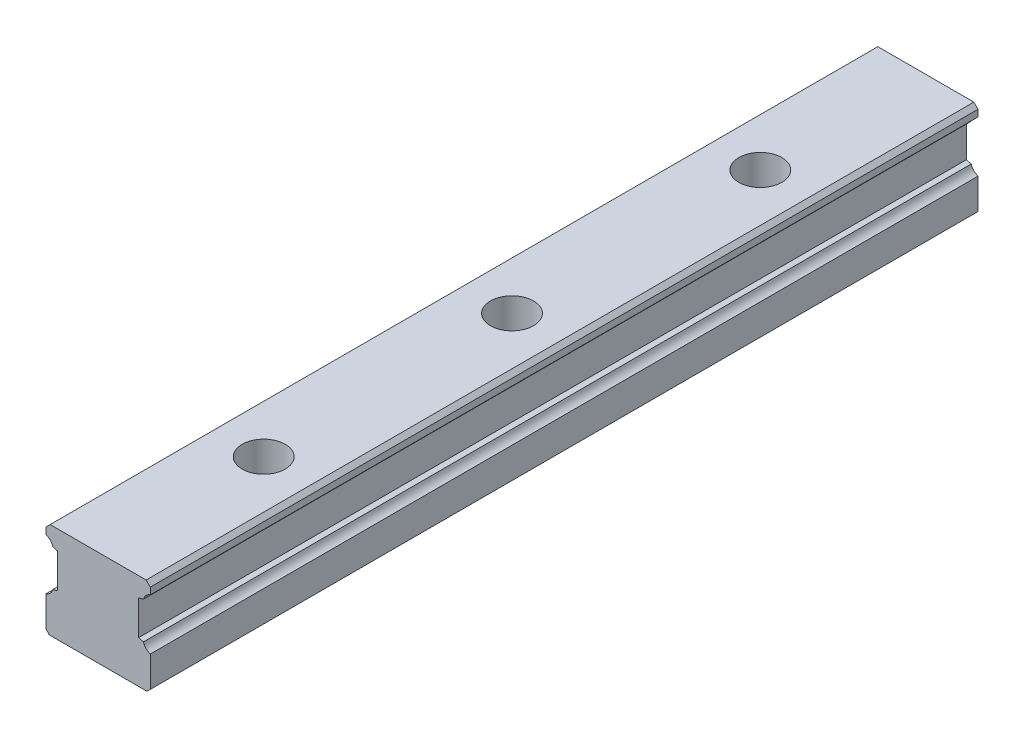
ISO-10303-21;
HEADER;
FILE_DESCRIPTION(('STEP AP214'),'2;1');
FILE_NAME('part.step','',(''),(''),'','','');
FILE_SCHEMA(('AUTOMOTIVE_DESIGN { 1 0 10303 214 1 1 1 1 }'));
ENDSEC;
DATA;
#1=APPLICATION_CONTEXT('core data for automotive mechanical design processes');
#2=APPLICATION_PROTOCOL_DEFINITION('international standard','automotive_design',2000,#1);
#3=PRODUCT_CONTEXT('',#1,'mechanical');
#4=PRODUCT('Part','Part','',(#3));
#5=PRODUCT_RELATED_PRODUCT_CATEGORY('part','',(#4));
#6=PRODUCT_DEFINITION_FORMATION('','',#4);
#7=PRODUCT_DEFINITION_CONTEXT('part definition',#1,'design');
#8=PRODUCT_DEFINITION('design','',#6,#7);
#9=PRODUCT_DEFINITION_SHAPE('','',#8);
#10=(LENGTH_UNIT() NAMED_UNIT(*) SI_UNIT(.MILLI.,.METRE.));
#11=(NAMED_UNIT(*) PLANE_ANGLE_UNIT() SI_UNIT($,.RADIAN.));
#12=(NAMED_UNIT(*) SI_UNIT($,.STERADIAN.) SOLID_ANGLE_UNIT());
#13=UNCERTAINTY_MEASURE_WITH_UNIT(LENGTH_MEASURE(1.E-05),#10,'distance_accuracy_value','');
#14=(GEOMETRIC_REPRESENTATION_CONTEXT(3) GLOBAL_UNCERTAINTY_ASSIGNED_CONTEXT((#13)) GLOBAL_UNIT_ASSIGNED_CONTEXT((#10,
#11,#12)) REPRESENTATION_CONTEXT('',''));
#15=CARTESIAN_POINT('',(0.,0.,0.));
#16=DIRECTION('',(0.,0.,1.));
#17=DIRECTION('',(1.,0.,0.));
#18=AXIS2_PLACEMENT_3D('',#15,#16,#17);
#19=CARTESIAN_POINT('',(-33.3777226859024,26.4266666882063,500.));
#20=DIRECTION('',(0.,0.,-1.));
#21=DIRECTION('',(-1.,0.,0.));
#22=AXIS2_PLACEMENT_3D('',#19,#20,#21);
#23=CYLINDRICAL_SURFACE('',#22,6.19099198633477);
#24=CARTESIAN_POINT('',(-33.3777226859024,26.4266666882063,0.));
#25=DIRECTION('',(0.,0.,-1.));
#26=DIRECTION('',(-1.,0.,0.));
#27=AXIS2_PLACEMENT_3D('',#24,#25,#26);
#28=CIRCLE('',#27,6.19099198633477);
#29=CARTESIAN_POINT('',(-27.3979395737064,24.823365186318,0.));
#30=VERTEX_POINT('',#29);
#31=CARTESIAN_POINT('',(-31.5,20.5272989856717,0.));
#32=VERTEX_POINT('',#31);
#33=EDGE_CURVE('E190',#30,#32,#28,.T.);
#34=ORIENTED_EDGE('',*,*,#33,.T.);
#35=DIRECTION('',(0.,0.,-1.));
#36=VECTOR('',#35,1.);
#37=CARTESIAN_POINT('',(-31.5,20.5272989856717,500.));
#38=LINE('',#37,#36);
#39=CARTESIAN_POINT('',(-31.5,20.5272989856717,500.));
#40=VERTEX_POINT('',#39);
#41=EDGE_CURVE('E173',#40,#32,#38,.T.);
#42=ORIENTED_EDGE('',*,*,#41,.F.);
#43=CARTESIAN_POINT('',(-33.3777226859024,26.4266666882063,500.));
#44=DIRECTION('',(0.,0.,-1.));
#45=DIRECTION('',(-1.,0.,0.));
#46=AXIS2_PLACEMENT_3D('',#43,#44,#45);
#47=CIRCLE('',#46,6.19099198633477);
#48=CARTESIAN_POINT('',(-27.3979395737064,24.823365186318,500.));
#49=VERTEX_POINT('',#48);
#50=EDGE_CURVE('E178',#49,#40,#47,.T.);
#51=ORIENTED_EDGE('',*,*,#50,.F.);
#52=DIRECTION('',(0.,0.,-1.));
#53=VECTOR('',#52,1.);
#54=CARTESIAN_POINT('',(-27.3979395737064,24.823365186318,500.));
#55=LINE('',#54,#53);
#56=EDGE_CURVE('E281',#49,#30,#55,.T.);
#57=ORIENTED_EDGE('',*,*,#56,.T.);
#58=EDGE_LOOP('',(#34,#42,#51,#57));
#59=FACE_BOUND('',#58,.T.);
#60=ADVANCED_FACE('F33',(#59),#23,.F.);
#61=CARTESIAN_POINT('',(-31.5,20.5272989856717,500.));
#62=DIRECTION('',(1.,0.,0.));
#63=DIRECTION('',(0.,1.,0.));
#64=AXIS2_PLACEMENT_3D('',#61,#62,#63);
#65=PLANE('',#64);
#66=DIRECTION('',(0.,-1.,0.));
#67=VECTOR('',#66,1.);
#68=CARTESIAN_POINT('',(-31.5,20.5272989856717,0.));
#69=LINE('',#68,#67);
#70=CARTESIAN_POINT('',(-31.5,2.,0.));
#71=VERTEX_POINT('',#70);
#72=EDGE_CURVE('E251',#32,#71,#69,.T.);
#73=ORIENTED_EDGE('',*,*,#72,.T.);
#74=DIRECTION('',(0.,0.,1.));
#75=VECTOR('',#74,1.);
#76=CARTESIAN_POINT('',(-31.5,2.,500.));
#77=LINE('',#76,#75);
#78=CARTESIAN_POINT('',(-31.5,2.,500.));
#79=VERTEX_POINT('',#78);
#80=EDGE_CURVE('E11',#71,#79,#77,.T.);
#81=ORIENTED_EDGE('',*,*,#80,.T.);
#82=DIRECTION('',(0.,-1.,0.));
#83=VECTOR('',#82,1.);
#84=CARTESIAN_POINT('',(-31.5,20.5272989856717,500.));
#85=LINE('',#84,#83);
#86=EDGE_CURVE('E169',#40,#79,#85,.T.);
#87=ORIENTED_EDGE('',*,*,#86,.F.);
#88=ORIENTED_EDGE('',*,*,#41,.T.);
#89=EDGE_LOOP('',(#73,#81,#87,#88));
#90=FACE_BOUND('',#89,.T.);
#91=ADVANCED_FACE('F171',(#90),#65,.F.);
#92=CARTESIAN_POINT('',(-31.5,0.,500.));
#93=DIRECTION('',(0.,1.,0.));
#94=DIRECTION('',(0.,0.,1.));
#95=AXIS2_PLACEMENT_3D('',#92,#93,#94);
#96=PLANE('',#95);
#97=CARTESIAN_POINT('',(0.,0.,100.));
#98=DIRECTION('',(0.,1.,0.));
#99=DIRECTION('',(0.,0.,1.));
#100=AXIS2_PLACEMENT_3D('',#97,#98,#99);
#101=CIRCLE('',#100,9.);
#102=CARTESIAN_POINT('',(0.,0.,109.));
#103=VERTEX_POINT('',#102);
#104=EDGE_CURVE('E675',#103,#103,#101,.T.);
#105=ORIENTED_EDGE('',*,*,#104,.T.);
#106=EDGE_LOOP('',(#105));
#107=FACE_BOUND('',#106,.T.);
#108=CARTESIAN_POINT('',(0.,0.,250.));
#109=DIRECTION('',(0.,1.,0.));
#110=DIRECTION('',(0.,0.,1.));
#111=AXIS2_PLACEMENT_3D('',#108,#109,#110);
#112=CIRCLE('',#111,9.);
#113=CARTESIAN_POINT('',(0.,0.,259.));
#114=VERTEX_POINT('',#113);
#115=EDGE_CURVE('E678',#114,#114,#112,.T.);
#116=ORIENTED_EDGE('',*,*,#115,.T.);
#117=EDGE_LOOP('',(#116));
#118=FACE_BOUND('',#117,.T.);
#119=CARTESIAN_POINT('',(0.,0.,400.));
#120=DIRECTION('',(0.,1.,0.));
#121=DIRECTION('',(0.,0.,1.));
#122=AXIS2_PLACEMENT_3D('',#119,#120,#121);
#123=CIRCLE('',#122,9.);
#124=CARTESIAN_POINT('',(0.,0.,409.));
#125=VERTEX_POINT('',#124);
#126=EDGE_CURVE('E348',#125,#125,#123,.T.);
#127=ORIENTED_EDGE('',*,*,#126,.T.);
#128=EDGE_LOOP('',(#127));
#129=FACE_BOUND('',#128,.T.);
#130=DIRECTION('',(1.,0.,0.));
#131=VECTOR('',#130,1.);
#132=CARTESIAN_POINT('',(-31.5,0.,0.));
#133=LINE('',#132,#131);
#134=CARTESIAN_POINT('',(-29.5,0.,0.));
#135=VERTEX_POINT('',#134);
#136=CARTESIAN_POINT('',(29.5,0.,0.));
#137=VERTEX_POINT('',#136);
#138=EDGE_CURVE('E246',#135,#137,#133,.T.);
#139=ORIENTED_EDGE('',*,*,#138,.T.);
#140=DIRECTION('',(0.,0.,1.));
#141=VECTOR('',#140,1.);
#142=CARTESIAN_POINT('',(29.5,0.,500.));
#143=LINE('',#142,#141);
#144=CARTESIAN_POINT('',(29.5,0.,500.));
#145=VERTEX_POINT('',#144);
#146=EDGE_CURVE('E54',#137,#145,#143,.T.);
#147=ORIENTED_EDGE('',*,*,#146,.T.);
#148=DIRECTION('',(1.,0.,0.));
#149=VECTOR('',#148,1.);
#150=CARTESIAN_POINT('',(-31.5,0.,500.));
#151=LINE('',#150,#149);
#152=CARTESIAN_POINT('',(-29.5,0.,500.));
#153=VERTEX_POINT('',#152);
#154=EDGE_CURVE('E177',#153,#145,#151,.T.);
#155=ORIENTED_EDGE('',*,*,#154,.F.);
#156=DIRECTION('',(0.,0.,-1.));
#157=VECTOR('',#156,1.);
#158=CARTESIAN_POINT('',(-29.5,0.,500.));
#159=LINE('',#158,#157);
#160=EDGE_CURVE('E225',#153,#135,#159,.T.);
#161=ORIENTED_EDGE('',*,*,#160,.T.);
#162=EDGE_LOOP('',(#139,#147,#155,#161));
#163=FACE_BOUND('',#162,.T.);
#164=ADVANCED_FACE('F249',(#107,#118,#129,#163),#96,.F.);
#165=CARTESIAN_POINT('',(31.5,0.,500.));
#166=DIRECTION('',(-1.,0.,0.));
#167=DIRECTION('',(0.,-1.,0.));
#168=AXIS2_PLACEMENT_3D('',#165,#166,#167);
#169=PLANE('',#168);
#170=DIRECTION('',(0.,1.,0.));
#171=VECTOR('',#170,1.);
#172=CARTESIAN_POINT('',(31.5,0.,500.));
#173=LINE('',#172,#171);
#174=CARTESIAN_POINT('',(31.5,2.,500.));
#175=VERTEX_POINT('',#174);
#176=CARTESIAN_POINT('',(31.5,20.5272989856717,500.));
#177=VERTEX_POINT('',#176);
#178=EDGE_CURVE('E232',#175,#177,#173,.T.);
#179=ORIENTED_EDGE('',*,*,#178,.F.);
#180=DIRECTION('',(0.,0.,-1.));
#181=VECTOR('',#180,1.);
#182=CARTESIAN_POINT('',(31.5,2.,500.));
#183=LINE('',#182,#181);
#184=CARTESIAN_POINT('',(31.5,2.00000000000001,0.));
#185=VERTEX_POINT('',#184);
#186=EDGE_CURVE('E218',#175,#185,#183,.T.);
#187=ORIENTED_EDGE('',*,*,#186,.T.);
#188=DIRECTION('',(0.,1.,0.));
#189=VECTOR('',#188,1.);
#190=CARTESIAN_POINT('',(31.5,0.,0.));
#191=LINE('',#190,#189);
#192=CARTESIAN_POINT('',(31.5,20.5272989856717,0.));
#193=VERTEX_POINT('',#192);
#194=EDGE_CURVE('E248',#185,#193,#191,.T.);
#195=ORIENTED_EDGE('',*,*,#194,.T.);
#196=DIRECTION('',(0.,0.,-1.));
#197=VECTOR('',#196,1.);
#198=CARTESIAN_POINT('',(31.5,20.5272989856717,500.));
#199=LINE('',#198,#197);
#200=EDGE_CURVE('E192',#177,#193,#199,.T.);
#201=ORIENTED_EDGE('',*,*,#200,.F.);
#202=EDGE_LOOP('',(#179,#187,#195,#201));
#203=FACE_BOUND('',#202,.T.);
#204=ADVANCED_FACE('F237',(#203),#169,.F.);
#205=CARTESIAN_POINT('',(33.3764580383009,26.4270690663916,500.));
#206=DIRECTION('',(0.,0.,-1.));
#207=DIRECTION('',(-1.,0.,0.));
#208=AXIS2_PLACEMENT_3D('',#205,#206,#207);
#209=CYLINDRICAL_SURFACE('',#208,6.19099198633479);
#210=CARTESIAN_POINT('',(33.3764580383009,26.4270690663916,0.));
#211=DIRECTION('',(0.,0.,-1.));
#212=DIRECTION('',(-1.,0.,0.));
#213=AXIS2_PLACEMENT_3D('',#210,#211,#212);
#214=CIRCLE('',#213,6.19099198633479);
#215=CARTESIAN_POINT('',(27.3972660609101,24.8215644502767,0.));
#216=VERTEX_POINT('',#215);
#217=EDGE_CURVE('E253',#193,#216,#214,.T.);
#218=ORIENTED_EDGE('',*,*,#217,.T.);
#219=DIRECTION('',(0.,0.,-1.));
#220=VECTOR('',#219,1.);
#221=CARTESIAN_POINT('',(27.3972660609101,24.8215644502767,500.));
#222=LINE('',#221,#220);
#223=CARTESIAN_POINT('',(27.3972660609101,24.8215644502767,500.));
#224=VERTEX_POINT('',#223);
#225=EDGE_CURVE('E198',#224,#216,#222,.T.);
#226=ORIENTED_EDGE('',*,*,#225,.F.);
#227=CARTESIAN_POINT('',(33.3764580383009,26.4270690663916,500.));
#228=DIRECTION('',(0.,0.,-1.));
#229=DIRECTION('',(-1.,0.,0.));
#230=AXIS2_PLACEMENT_3D('',#227,#228,#229);
#231=CIRCLE('',#230,6.19099198633479);
#232=EDGE_CURVE('E240',#177,#224,#231,.T.);
#233=ORIENTED_EDGE('',*,*,#232,.F.);
#234=ORIENTED_EDGE('',*,*,#200,.T.);
#235=EDGE_LOOP('',(#218,#226,#233,#234));
#236=FACE_BOUND('',#235,.T.);
#237=ADVANCED_FACE('F360',(#236),#209,.F.);
#238=CARTESIAN_POINT('',(27.3972660609101,24.8215644502767,500.));
#239=DIRECTION('',(-0.258818484515107,-0.965925976497839,0.));
#240=DIRECTION('',(0.965925976497839,-0.258818484515107,0.));
#241=AXIS2_PLACEMENT_3D('',#238,#239,#240);
#242=PLANE('',#241);
#243=DIRECTION('',(-0.965925976497839,0.258818484515107,0.));
#244=VECTOR('',#243,1.);
#245=CARTESIAN_POINT('',(27.3972660609101,24.8215644502767,0.));
#246=LINE('',#245,#244);
#247=CARTESIAN_POINT('',(24.5,25.5978827493668,0.));
#248=VERTEX_POINT('',#247);
#249=EDGE_CURVE('E259',#216,#248,#246,.T.);
#250=ORIENTED_EDGE('',*,*,#249,.T.);
#251=DIRECTION('',(0.,0.,-1.));
#252=VECTOR('',#251,1.);
#253=CARTESIAN_POINT('',(24.5,25.5978827493668,500.));
#254=LINE('',#253,#252);
#255=CARTESIAN_POINT('',(24.5,25.5978827493668,500.));
#256=VERTEX_POINT('',#255);
#257=EDGE_CURVE('E304',#256,#248,#254,.T.);
#258=ORIENTED_EDGE('',*,*,#257,.F.);
#259=DIRECTION('',(-0.965925976497839,0.258818484515107,0.));
#260=VECTOR('',#259,1.);
#261=CARTESIAN_POINT('',(27.3972660609101,24.8215644502767,500.));
#262=LINE('',#261,#260);
#263=EDGE_CURVE('E313',#224,#256,#262,.T.);
#264=ORIENTED_EDGE('',*,*,#263,.F.);
#265=ORIENTED_EDGE('',*,*,#225,.T.);
#266=EDGE_LOOP('',(#250,#258,#264,#265));
#267=FACE_BOUND('',#266,.T.);
#268=ADVANCED_FACE('F311',(#267),#242,.F.);
#269=CARTESIAN_POINT('',(24.5,25.5978827493668,500.));
#270=DIRECTION('',(-1.,0.,0.));
#271=DIRECTION('',(0.,0.,1.));
#272=AXIS2_PLACEMENT_3D('',#269,#270,#271);
#273=PLANE('',#272);
#274=DIRECTION('',(0.,1.,0.));
#275=VECTOR('',#274,1.);
#276=CARTESIAN_POINT('',(24.5,25.5978827493668,0.));
#277=LINE('',#276,#275);
#278=CARTESIAN_POINT('',(24.5,46.3976861971019,0.));
#279=VERTEX_POINT('',#278);
#280=EDGE_CURVE('E261',#248,#279,#277,.T.);
#281=ORIENTED_EDGE('',*,*,#280,.T.);
#282=DIRECTION('',(0.,0.,-1.));
#283=VECTOR('',#282,1.);
#284=CARTESIAN_POINT('',(24.5,46.3976861971019,500.));
#285=LINE('',#284,#283);
#286=CARTESIAN_POINT('',(24.5,46.3976861971019,500.));
#287=VERTEX_POINT('',#286);
#288=EDGE_CURVE('E301',#287,#279,#285,.T.);
#289=ORIENTED_EDGE('',*,*,#288,.F.);
#290=DIRECTION('',(0.,1.,0.));
#291=VECTOR('',#290,1.);
#292=CARTESIAN_POINT('',(24.5,25.5978827493668,500.));
#293=LINE('',#292,#291);
#294=EDGE_CURVE('E329',#256,#287,#293,.T.);
#295=ORIENTED_EDGE('',*,*,#294,.F.);
#296=ORIENTED_EDGE('',*,*,#257,.T.);
#297=EDGE_LOOP('',(#281,#289,#295,#296));
#298=FACE_BOUND('',#297,.T.);
#299=ADVANCED_FACE('F320',(#298),#273,.F.);
#300=CARTESIAN_POINT('',(24.5,46.3976861971019,500.));
#301=DIRECTION('',(-0.258791712283628,0.965933149681337,0.));
#302=DIRECTION('',(-0.965933149681337,-0.258791712283628,0.));
#303=AXIS2_PLACEMENT_3D('',#300,#301,#302);
#304=PLANE('',#303);
#305=DIRECTION('',(0.965933149681337,0.258791712283628,0.));
#306=VECTOR('',#305,1.);
#307=CARTESIAN_POINT('',(24.5,46.3976861971019,0.));
#308=LINE('',#307,#306);
#309=CARTESIAN_POINT('',(27.3971197121364,47.1738792196125,0.));
#310=VERTEX_POINT('',#309);
#311=EDGE_CURVE('E263',#279,#310,#308,.T.);
#312=ORIENTED_EDGE('',*,*,#311,.T.);
#313=DIRECTION('',(0.,0.,-1.));
#314=VECTOR('',#313,1.);
#315=CARTESIAN_POINT('',(27.3971197121364,47.1738792196125,500.));
#316=LINE('',#315,#314);
#317=CARTESIAN_POINT('',(27.3971197121364,47.1738792196125,500.));
#318=VERTEX_POINT('',#317);
#319=EDGE_CURVE('E298',#318,#310,#316,.T.);
#320=ORIENTED_EDGE('',*,*,#319,.F.);
#321=DIRECTION('',(0.965933149681337,0.258791712283628,0.));
#322=VECTOR('',#321,1.);
#323=CARTESIAN_POINT('',(24.5,46.3976861971019,500.));
#324=LINE('',#323,#322);
#325=EDGE_CURVE('E326',#287,#318,#324,.T.);
#326=ORIENTED_EDGE('',*,*,#325,.F.);
#327=ORIENTED_EDGE('',*,*,#288,.T.);
#328=EDGE_LOOP('',(#312,#320,#326,#327));
#329=FACE_BOUND('',#328,.T.);
#330=ADVANCED_FACE('F324',(#329),#304,.F.);
#331=CARTESIAN_POINT('',(33.3782102064319,45.5757339298287,500.));
#332=DIRECTION('',(0.,0.,-1.));
#333=DIRECTION('',(-1.,0.,0.));
#334=AXIS2_PLACEMENT_3D('',#331,#332,#333);
#335=CYLINDRICAL_SURFACE('',#334,6.19092173009895);
#336=CARTESIAN_POINT('',(33.3782102064319,45.5757339298287,0.));
#337=DIRECTION('',(0.,0.,-1.));
#338=DIRECTION('',(-1.,0.,0.));
#339=AXIS2_PLACEMENT_3D('',#336,#337,#338);
#340=CIRCLE('',#339,6.19092173009895);
#341=CARTESIAN_POINT('',(31.5,51.4748727049946,0.));
#342=VERTEX_POINT('',#341);
#343=EDGE_CURVE('E265',#310,#342,#340,.T.);
#344=ORIENTED_EDGE('',*,*,#343,.T.);
#345=DIRECTION('',(0.,0.,-1.));
#346=VECTOR('',#345,1.);
#347=CARTESIAN_POINT('',(31.5,51.4748727049946,500.));
#348=LINE('',#347,#346);
#349=CARTESIAN_POINT('',(31.5,51.4748727049946,500.));
#350=VERTEX_POINT('',#349);
#351=EDGE_CURVE('E295',#350,#342,#348,.T.);
#352=ORIENTED_EDGE('',*,*,#351,.F.);
#353=CARTESIAN_POINT('',(33.3782102064319,45.5757339298287,500.));
#354=DIRECTION('',(0.,0.,-1.));
#355=DIRECTION('',(-1.,0.,0.));
#356=AXIS2_PLACEMENT_3D('',#353,#354,#355);
#357=CIRCLE('',#356,6.19092173009895);
#358=EDGE_CURVE('E328',#318,#350,#357,.T.);
#359=ORIENTED_EDGE('',*,*,#358,.F.);
#360=ORIENTED_EDGE('',*,*,#319,.T.);
#361=EDGE_LOOP('',(#344,#352,#359,#360));
#362=FACE_BOUND('',#361,.T.);
#363=ADVANCED_FACE('F431',(#362),#335,.F.);
#364=CARTESIAN_POINT('',(31.5,51.4748727049946,500.));
#365=DIRECTION('',(-1.,0.,0.));
#366=DIRECTION('',(0.,0.,1.));
#367=AXIS2_PLACEMENT_3D('',#364,#365,#366);
#368=PLANE('',#367);
#369=DIRECTION('',(0.,1.,0.));
#370=VECTOR('',#369,1.);
#371=CARTESIAN_POINT('',(31.5,51.4748727049946,0.));
#372=LINE('',#371,#370);
#373=CARTESIAN_POINT('',(31.5,55.4997125453559,0.));
#374=VERTEX_POINT('',#373);
#375=EDGE_CURVE('E267',#342,#374,#372,.T.);
#376=ORIENTED_EDGE('',*,*,#375,.T.);
#377=DIRECTION('',(0.,0.,1.));
#378=VECTOR('',#377,1.);
#379=CARTESIAN_POINT('',(31.5,55.4997125453559,500.));
#380=LINE('',#379,#378);
#381=CARTESIAN_POINT('',(31.5,55.4997125453559,500.));
#382=VERTEX_POINT('',#381);
#383=EDGE_CURVE('E214',#374,#382,#380,.T.);
#384=ORIENTED_EDGE('',*,*,#383,.T.);
#385=DIRECTION('',(0.,1.,0.));
#386=VECTOR('',#385,1.);
#387=CARTESIAN_POINT('',(31.5,51.4748727049946,500.));
#388=LINE('',#387,#386);
#389=EDGE_CURVE('E331',#350,#382,#388,.T.);
#390=ORIENTED_EDGE('',*,*,#389,.F.);
#391=ORIENTED_EDGE('',*,*,#351,.T.);
#392=EDGE_LOOP('',(#376,#384,#390,#391));
#393=FACE_BOUND('',#392,.T.);
#394=ADVANCED_FACE('F428',(#393),#368,.F.);
#395=CARTESIAN_POINT('',(31.5,58.,500.));
#396=DIRECTION('',(0.,-1.,0.));
#397=DIRECTION('',(1.,0.,0.));
#398=AXIS2_PLACEMENT_3D('',#395,#396,#397);
#399=PLANE('',#398);
#400=CARTESIAN_POINT('',(0.,58.,100.));
#401=DIRECTION('',(0.,1.,0.));
#402=DIRECTION('',(0.,0.,1.));
#403=AXIS2_PLACEMENT_3D('',#400,#401,#402);
#404=CIRCLE('',#403,13.);
#405=CARTESIAN_POINT('',(0.,58.,113.));
#406=VERTEX_POINT('',#405);
#407=EDGE_CURVE('E706',#406,#406,#404,.T.);
#408=ORIENTED_EDGE('',*,*,#407,.F.);
#409=EDGE_LOOP('',(#408));
#410=FACE_BOUND('',#409,.T.);
#411=CARTESIAN_POINT('',(0.,58.,250.));
#412=DIRECTION('',(0.,1.,0.));
#413=DIRECTION('',(0.,0.,1.));
#414=AXIS2_PLACEMENT_3D('',#411,#412,#413);
#415=CIRCLE('',#414,13.);
#416=CARTESIAN_POINT('',(0.,58.,263.));
#417=VERTEX_POINT('',#416);
#418=EDGE_CURVE('E696',#417,#417,#415,.T.);
#419=ORIENTED_EDGE('',*,*,#418,.F.);
#420=EDGE_LOOP('',(#419));
#421=FACE_BOUND('',#420,.T.);
#422=CARTESIAN_POINT('',(0.,58.,400.));
#423=DIRECTION('',(0.,1.,0.));
#424=DIRECTION('',(0.,0.,1.));
#425=AXIS2_PLACEMENT_3D('',#422,#423,#424);
#426=CIRCLE('',#425,13.);
#427=CARTESIAN_POINT('',(0.,58.,413.));
#428=VERTEX_POINT('',#427);
#429=EDGE_CURVE('E679',#428,#428,#426,.T.);
#430=ORIENTED_EDGE('',*,*,#429,.F.);
#431=EDGE_LOOP('',(#430));
#432=FACE_BOUND('',#431,.T.);
#433=DIRECTION('',(-1.,0.,0.));
#434=VECTOR('',#433,1.);
#435=CARTESIAN_POINT('',(31.5,58.,500.));
#436=LINE('',#435,#434);
#437=CARTESIAN_POINT('',(28.9995762209438,58.,500.));
#438=VERTEX_POINT('',#437);
#439=CARTESIAN_POINT('',(-28.999742754951,58.,500.));
#440=VERTEX_POINT('',#439);
#441=EDGE_CURVE('E338',#438,#440,#436,.T.);
#442=ORIENTED_EDGE('',*,*,#441,.F.);
#443=DIRECTION('',(0.,0.,-1.));
#444=VECTOR('',#443,1.);
#445=CARTESIAN_POINT('',(28.9995762209438,58.,500.));
#446=LINE('',#445,#444);
#447=CARTESIAN_POINT('',(28.9995762209438,58.,0.));
#448=VERTEX_POINT('',#447);
#449=EDGE_CURVE('E209',#438,#448,#446,.T.);
#450=ORIENTED_EDGE('',*,*,#449,.T.);
#451=DIRECTION('',(-1.,0.,0.));
#452=VECTOR('',#451,1.);
#453=CARTESIAN_POINT('',(31.5,58.,0.));
#454=LINE('',#453,#452);
#455=CARTESIAN_POINT('',(-28.999742754951,58.,0.));
#456=VERTEX_POINT('',#455);
#457=EDGE_CURVE('E270',#448,#456,#454,.T.);
#458=ORIENTED_EDGE('',*,*,#457,.T.);
#459=DIRECTION('',(0.,0.,1.));
#460=VECTOR('',#459,1.);
#461=CARTESIAN_POINT('',(-28.999742754951,58.,500.));
#462=LINE('',#461,#460);
#463=EDGE_CURVE('E204',#456,#440,#462,.T.);
#464=ORIENTED_EDGE('',*,*,#463,.T.);
#465=EDGE_LOOP('',(#442,#450,#458,#464));
#466=FACE_BOUND('',#465,.T.);
#467=ADVANCED_FACE('F422',(#410,#421,#432,#466),#399,.F.);
#468=CARTESIAN_POINT('',(-31.5,58.,500.));
#469=DIRECTION('',(1.,0.,0.));
#470=DIRECTION('',(0.,0.,-1.));
#471=AXIS2_PLACEMENT_3D('',#468,#469,#470);
#472=PLANE('',#471);
#473=DIRECTION('',(0.,-1.,0.));
#474=VECTOR('',#473,1.);
#475=CARTESIAN_POINT('',(-31.5,58.,500.));
#476=LINE('',#475,#474);
#477=CARTESIAN_POINT('',(-31.5,55.4997125453559,500.));
#478=VERTEX_POINT('',#477);
#479=CARTESIAN_POINT('',(-31.5,51.4748727049946,500.));
#480=VERTEX_POINT('',#479);
#481=EDGE_CURVE('E340',#478,#480,#476,.T.);
#482=ORIENTED_EDGE('',*,*,#481,.F.);
#483=DIRECTION('',(0.,0.,-1.));
#484=VECTOR('',#483,1.);
#485=CARTESIAN_POINT('',(-31.5,55.4997125453559,500.));
#486=LINE('',#485,#484);
#487=CARTESIAN_POINT('',(-31.5,55.4997125453559,0.));
#488=VERTEX_POINT('',#487);
#489=EDGE_CURVE('E191',#478,#488,#486,.T.);
#490=ORIENTED_EDGE('',*,*,#489,.T.);
#491=DIRECTION('',(0.,-1.,0.));
#492=VECTOR('',#491,1.);
#493=CARTESIAN_POINT('',(-31.5,58.,0.));
#494=LINE('',#493,#492);
#495=CARTESIAN_POINT('',(-31.5,51.4748727049946,0.));
#496=VERTEX_POINT('',#495);
#497=EDGE_CURVE('E272',#488,#496,#494,.T.);
#498=ORIENTED_EDGE('',*,*,#497,.T.);
#499=DIRECTION('',(0.,0.,-1.));
#500=VECTOR('',#499,1.);
#501=CARTESIAN_POINT('',(-31.5,51.4748727049946,500.));
#502=LINE('',#501,#500);
#503=EDGE_CURVE('E292',#480,#496,#502,.T.);
#504=ORIENTED_EDGE('',*,*,#503,.F.);
#505=EDGE_LOOP('',(#482,#490,#498,#504));
#506=FACE_BOUND('',#505,.T.);
#507=ADVANCED_FACE('F414',(#506),#472,.F.);
#508=CARTESIAN_POINT('',(-33.3784417707757,45.5757339298287,500.));
#509=DIRECTION('',(0.,0.,-1.));
#510=DIRECTION('',(-1.,0.,0.));
#511=AXIS2_PLACEMENT_3D('',#508,#509,#510);
#512=CYLINDRICAL_SURFACE('',#511,6.19099198633477);
#513=CARTESIAN_POINT('',(-33.3784417707757,45.5757339298287,0.));
#514=DIRECTION('',(0.,0.,-1.));
#515=DIRECTION('',(-1.,0.,0.));
#516=AXIS2_PLACEMENT_3D('',#513,#514,#515);
#517=CIRCLE('',#516,6.19099198633477);
#518=CARTESIAN_POINT('',(-27.3978021352707,47.1758374655687,0.));
#519=VERTEX_POINT('',#518);
#520=EDGE_CURVE('E274',#496,#519,#517,.T.);
#521=ORIENTED_EDGE('',*,*,#520,.T.);
#522=DIRECTION('',(0.,0.,-1.));
#523=VECTOR('',#522,1.);
#524=CARTESIAN_POINT('',(-27.3978021352707,47.1758374655687,500.));
#525=LINE('',#524,#523);
#526=CARTESIAN_POINT('',(-27.3978021352707,47.1758374655687,500.));
#527=VERTEX_POINT('',#526);
#528=EDGE_CURVE('E289',#527,#519,#525,.T.);
#529=ORIENTED_EDGE('',*,*,#528,.F.);
#530=CARTESIAN_POINT('',(-33.3784417707757,45.5757339298287,500.));
#531=DIRECTION('',(0.,0.,-1.));
#532=DIRECTION('',(-1.,0.,0.));
#533=AXIS2_PLACEMENT_3D('',#530,#531,#532);
#534=CIRCLE('',#533,6.19099198633477);
#535=EDGE_CURVE('E342',#480,#527,#534,.T.);
#536=ORIENTED_EDGE('',*,*,#535,.F.);
#537=ORIENTED_EDGE('',*,*,#503,.T.);
#538=EDGE_LOOP('',(#521,#529,#536,#537));
#539=FACE_BOUND('',#538,.T.);
#540=ADVANCED_FACE('F409',(#539),#512,.F.);
#541=CARTESIAN_POINT('',(-27.3978021352707,47.1758374655687,500.));
#542=DIRECTION('',(0.258715586600087,0.965953541972994,0.));
#543=DIRECTION('',(-0.965953541972994,0.258715586600087,0.));
#544=AXIS2_PLACEMENT_3D('',#541,#542,#543);
#545=PLANE('',#544);
#546=DIRECTION('',(0.965953541972994,-0.258715586600087,0.));
#547=VECTOR('',#546,1.);
#548=CARTESIAN_POINT('',(-27.3978021352707,47.1758374655687,0.));
#549=LINE('',#548,#547);
#550=CARTESIAN_POINT('',(-24.5,46.3997063715761,0.));
#551=VERTEX_POINT('',#550);
#552=EDGE_CURVE('E276',#519,#551,#549,.T.);
#553=ORIENTED_EDGE('',*,*,#552,.T.);
#554=DIRECTION('',(0.,0.,-1.));
#555=VECTOR('',#554,1.);
#556=CARTESIAN_POINT('',(-24.5,46.3997063715761,500.));
#557=LINE('',#556,#555);
#558=CARTESIAN_POINT('',(-24.5,46.3997063715761,500.));
#559=VERTEX_POINT('',#558);
#560=EDGE_CURVE('E286',#559,#551,#557,.T.);
#561=ORIENTED_EDGE('',*,*,#560,.F.);
#562=DIRECTION('',(0.965953541972994,-0.258715586600087,0.));
#563=VECTOR('',#562,1.);
#564=CARTESIAN_POINT('',(-27.3978021352707,47.1758374655687,500.));
#565=LINE('',#564,#563);
#566=EDGE_CURVE('E344',#527,#559,#565,.T.);
#567=ORIENTED_EDGE('',*,*,#566,.F.);
#568=ORIENTED_EDGE('',*,*,#528,.T.);
#569=EDGE_LOOP('',(#553,#561,#567,#568));
#570=FACE_BOUND('',#569,.T.);
#571=ADVANCED_FACE('F404',(#570),#545,.F.);
#572=CARTESIAN_POINT('',(-24.5,46.3997063715761,500.));
#573=DIRECTION('',(1.,0.,0.));
#574=DIRECTION('',(0.,1.,0.));
#575=AXIS2_PLACEMENT_3D('',#572,#573,#574);
#576=PLANE('',#575);
#577=DIRECTION('',(0.,-1.,0.));
#578=VECTOR('',#577,1.);
#579=CARTESIAN_POINT('',(-24.5,46.3997063715761,0.));
#580=LINE('',#579,#578);
#581=CARTESIAN_POINT('',(-24.5,25.5969732365157,0.));
#582=VERTEX_POINT('',#581);
#583=EDGE_CURVE('E278',#551,#582,#580,.T.);
#584=ORIENTED_EDGE('',*,*,#583,.T.);
#585=DIRECTION('',(0.,0.,-1.));
#586=VECTOR('',#585,1.);
#587=CARTESIAN_POINT('',(-24.5,25.5969732365157,500.));
#588=LINE('',#587,#586);
#589=CARTESIAN_POINT('',(-24.5,25.5969732365157,500.));
#590=VERTEX_POINT('',#589);
#591=EDGE_CURVE('E283',#590,#582,#588,.T.);
#592=ORIENTED_EDGE('',*,*,#591,.F.);
#593=DIRECTION('',(0.,-1.,0.));
#594=VECTOR('',#593,1.);
#595=CARTESIAN_POINT('',(-24.5,46.3997063715761,500.));
#596=LINE('',#595,#594);
#597=EDGE_CURVE('E346',#559,#590,#596,.T.);
#598=ORIENTED_EDGE('',*,*,#597,.F.);
#599=ORIENTED_EDGE('',*,*,#560,.T.);
#600=EDGE_LOOP('',(#584,#592,#598,#599));
#601=FACE_BOUND('',#600,.T.);
#602=ADVANCED_FACE('F400',(#601),#576,.F.);
#603=CARTESIAN_POINT('',(-24.5,25.5969732365157,500.));
#604=DIRECTION('',(0.257919173568785,-0.966166496989828,0.));
#605=DIRECTION('',(0.966166496989828,0.257919173568785,0.));
#606=AXIS2_PLACEMENT_3D('',#603,#604,#605);
#607=PLANE('',#606);
#608=DIRECTION('',(-0.966166496989828,-0.257919173568785,0.));
#609=VECTOR('',#608,1.);
#610=CARTESIAN_POINT('',(-24.5,25.5969732365157,0.));
#611=LINE('',#610,#609);
#612=EDGE_CURVE('E187',#582,#30,#611,.T.);
#613=ORIENTED_EDGE('',*,*,#612,.T.);
#614=ORIENTED_EDGE('',*,*,#56,.F.);
#615=DIRECTION('',(-0.966166496989828,-0.257919173568785,0.));
#616=VECTOR('',#615,1.);
#617=CARTESIAN_POINT('',(-24.5,25.5969732365157,500.));
#618=LINE('',#617,#616);
#619=EDGE_CURVE('E183',#590,#49,#618,.T.);
#620=ORIENTED_EDGE('',*,*,#619,.F.);
#621=ORIENTED_EDGE('',*,*,#591,.T.);
#622=EDGE_LOOP('',(#613,#614,#620,#621));
#623=FACE_BOUND('',#622,.T.);
#624=ADVANCED_FACE('F396',(#623),#607,.F.);
#625=CARTESIAN_POINT('',(-33.3777226859024,26.4266666882063,500.));
#626=DIRECTION('',(0.,0.,-1.));
#627=DIRECTION('',(-1.,0.,0.));
#628=AXIS2_PLACEMENT_3D('',#625,#626,#627);
#629=PLANE('',#628);
#630=ORIENTED_EDGE('',*,*,#154,.T.);
#631=DIRECTION('',(-0.707106781186548,-0.707106781186548,0.));
#632=VECTOR('',#631,1.);
#633=CARTESIAN_POINT('',(31.5,2.,500.));
#634=LINE('',#633,#632);
#635=EDGE_CURVE('E41',#145,#175,#634,.F.);
#636=ORIENTED_EDGE('',*,*,#635,.T.);
#637=ORIENTED_EDGE('',*,*,#178,.T.);
#638=ORIENTED_EDGE('',*,*,#232,.T.);
#639=ORIENTED_EDGE('',*,*,#263,.T.);
#640=ORIENTED_EDGE('',*,*,#294,.T.);
#641=ORIENTED_EDGE('',*,*,#325,.T.);
#642=ORIENTED_EDGE('',*,*,#358,.T.);
#643=ORIENTED_EDGE('',*,*,#389,.T.);
#644=DIRECTION('',(0.70712605736502,-0.70708750448258,0.));
#645=VECTOR('',#644,1.);
#646=CARTESIAN_POINT('',(28.9995762209438,58.,500.));
#647=LINE('',#646,#645);
#648=EDGE_CURVE('E216',#382,#438,#647,.F.);
#649=ORIENTED_EDGE('',*,*,#648,.T.);
#650=ORIENTED_EDGE('',*,*,#441,.T.);
#651=DIRECTION('',(0.707102509357105,0.707111052990183,0.));
#652=VECTOR('',#651,1.);
#653=CARTESIAN_POINT('',(-31.5,55.4997125453559,500.));
#654=LINE('',#653,#652);
#655=EDGE_CURVE('E207',#440,#478,#654,.F.);
#656=ORIENTED_EDGE('',*,*,#655,.T.);
#657=ORIENTED_EDGE('',*,*,#481,.T.);
#658=ORIENTED_EDGE('',*,*,#535,.T.);
#659=ORIENTED_EDGE('',*,*,#566,.T.);
#660=ORIENTED_EDGE('',*,*,#597,.T.);
#661=ORIENTED_EDGE('',*,*,#619,.T.);
#662=ORIENTED_EDGE('',*,*,#50,.T.);
#663=ORIENTED_EDGE('',*,*,#86,.T.);
#664=DIRECTION('',(-0.707106781186548,0.707106781186548,0.));
#665=VECTOR('',#664,1.);
#666=CARTESIAN_POINT('',(-29.5,0.,500.));
#667=LINE('',#666,#665);
#668=EDGE_CURVE('E229',#79,#153,#667,.F.);
#669=ORIENTED_EDGE('',*,*,#668,.T.);
#670=EDGE_LOOP('',(#630,#636,#637,#638,#639,#640,#641,#642,#643,#649,#650,#656,#657,#658,#659,
#660,#661,#662,#663,#669));
#671=FACE_BOUND('',#670,.T.);
#672=ADVANCED_FACE('F181',(#671),#629,.F.);
#673=CARTESIAN_POINT('',(-33.3777226859024,26.4266666882063,0.));
#674=DIRECTION('',(0.,0.,-1.));
#675=DIRECTION('',(-1.,0.,0.));
#676=AXIS2_PLACEMENT_3D('',#673,#674,#675);
#677=PLANE('',#676);
#678=ORIENTED_EDGE('',*,*,#194,.F.);
#679=DIRECTION('',(0.707106781186548,0.707106781186548,0.));
#680=VECTOR('',#679,1.);
#681=CARTESIAN_POINT('',(11.274472001152,-18.225527998848,0.));
#682=LINE('',#681,#680);
#683=EDGE_CURVE('E223',#185,#137,#682,.F.);
#684=ORIENTED_EDGE('',*,*,#683,.T.);
#685=ORIENTED_EDGE('',*,*,#138,.F.);
#686=DIRECTION('',(0.707106781186548,-0.707106781186548,0.));
#687=VECTOR('',#686,1.);
#688=CARTESIAN_POINT('',(-44.6521946870544,15.1521946870544,0.));
#689=LINE('',#688,#687);
#690=EDGE_CURVE('E221',#135,#71,#689,.F.);
#691=ORIENTED_EDGE('',*,*,#690,.T.);
#692=ORIENTED_EDGE('',*,*,#72,.F.);
#693=ORIENTED_EDGE('',*,*,#33,.F.);
#694=ORIENTED_EDGE('',*,*,#612,.F.);
#695=ORIENTED_EDGE('',*,*,#583,.F.);
#696=ORIENTED_EDGE('',*,*,#552,.F.);
#697=ORIENTED_EDGE('',*,*,#520,.F.);
#698=ORIENTED_EDGE('',*,*,#497,.F.);
#699=DIRECTION('',(-0.707102509357105,-0.707111052990183,0.));
#700=VECTOR('',#699,1.);
#701=CARTESIAN_POINT('',(-46.9753729266523,40.0241526360437,0.));
#702=LINE('',#701,#700);
#703=EDGE_CURVE('E195',#488,#456,#702,.F.);
#704=ORIENTED_EDGE('',*,*,#703,.T.);
#705=ORIENTED_EDGE('',*,*,#457,.F.);
#706=DIRECTION('',(-0.70712605736502,0.70708750448258,0.));
#707=VECTOR('',#706,1.);
#708=CARTESIAN_POINT('',(13.5958929321211,73.4028434719544,0.));
#709=LINE('',#708,#707);
#710=EDGE_CURVE('E212',#448,#374,#709,.F.);
#711=ORIENTED_EDGE('',*,*,#710,.T.);
#712=ORIENTED_EDGE('',*,*,#375,.F.);
#713=ORIENTED_EDGE('',*,*,#343,.F.);
#714=ORIENTED_EDGE('',*,*,#311,.F.);
#715=ORIENTED_EDGE('',*,*,#280,.F.);
#716=ORIENTED_EDGE('',*,*,#249,.F.);
#717=ORIENTED_EDGE('',*,*,#217,.F.);
#718=EDGE_LOOP('',(#678,#684,#685,#691,#692,#693,#694,#695,#696,#697,#698,#704,#705,#711,#712,
#713,#714,#715,#716,#717));
#719=FACE_BOUND('',#718,.T.);
#720=ADVANCED_FACE('F245',(#719),#677,.T.);
#721=CARTESIAN_POINT('',(0.,58.,400.));
#722=DIRECTION('',(0.,1.,0.));
#723=DIRECTION('',(0.,0.,1.));
#724=AXIS2_PLACEMENT_3D('',#721,#722,#723);
#725=CYLINDRICAL_SURFACE('',#724,9.00000000000001);
#726=ORIENTED_EDGE('',*,*,#126,.F.);
#727=EDGE_LOOP('',(#726));
#728=FACE_BOUND('',#727,.T.);
#729=CARTESIAN_POINT('',(0.,33.,400.));
#730=DIRECTION('',(0.,1.,0.));
#731=DIRECTION('',(0.,0.,1.));
#732=AXIS2_PLACEMENT_3D('',#729,#730,#731);
#733=CIRCLE('',#732,9.00000000000001);
#734=CARTESIAN_POINT('',(0.,33.,409.));
#735=VERTEX_POINT('',#734);
#736=EDGE_CURVE('E350',#735,#735,#733,.T.);
#737=ORIENTED_EDGE('',*,*,#736,.T.);
#738=EDGE_LOOP('',(#737));
#739=FACE_BOUND('',#738,.T.);
#740=ADVANCED_FACE('F497',(#728,#739),#725,.F.);
#741=CARTESIAN_POINT('',(9.00000000000001,33.,400.));
#742=DIRECTION('',(0.,-1.,0.));
#743=DIRECTION('',(0.,0.,-1.));
#744=AXIS2_PLACEMENT_3D('',#741,#742,#743);
#745=PLANE('',#744);
#746=ORIENTED_EDGE('',*,*,#736,.F.);
#747=EDGE_LOOP('',(#746));
#748=FACE_BOUND('',#747,.T.);
#749=CARTESIAN_POINT('',(0.,33.,400.));
#750=DIRECTION('',(0.,1.,0.));
#751=DIRECTION('',(0.,0.,1.));
#752=AXIS2_PLACEMENT_3D('',#749,#750,#751);
#753=CIRCLE('',#752,13.);
#754=CARTESIAN_POINT('',(0.,33.,413.));
#755=VERTEX_POINT('',#754);
#756=EDGE_CURVE('E355',#755,#755,#753,.T.);
#757=ORIENTED_EDGE('',*,*,#756,.T.);
#758=EDGE_LOOP('',(#757));
#759=FACE_BOUND('',#758,.T.);
#760=ADVANCED_FACE('F502',(#748,#759),#745,.F.);
#761=CARTESIAN_POINT('',(0.,58.,400.));
#762=DIRECTION('',(0.,1.,0.));
#763=DIRECTION('',(0.,0.,1.));
#764=AXIS2_PLACEMENT_3D('',#761,#762,#763);
#765=CYLINDRICAL_SURFACE('',#764,13.);
#766=ORIENTED_EDGE('',*,*,#756,.F.);
#767=EDGE_LOOP('',(#766));
#768=FACE_BOUND('',#767,.T.);
#769=ORIENTED_EDGE('',*,*,#429,.T.);
#770=EDGE_LOOP('',(#769));
#771=FACE_BOUND('',#770,.T.);
#772=ADVANCED_FACE('F514',(#768,#771),#765,.F.);
#773=CARTESIAN_POINT('',(0.,58.,250.));
#774=DIRECTION('',(0.,1.,0.));
#775=DIRECTION('',(0.,0.,1.));
#776=AXIS2_PLACEMENT_3D('',#773,#774,#775);
#777=CYLINDRICAL_SURFACE('',#776,9.00000000000001);
#778=ORIENTED_EDGE('',*,*,#115,.F.);
#779=EDGE_LOOP('',(#778));
#780=FACE_BOUND('',#779,.T.);
#781=CARTESIAN_POINT('',(0.,33.,250.));
#782=DIRECTION('',(0.,1.,0.));
#783=DIRECTION('',(0.,0.,1.));
#784=AXIS2_PLACEMENT_3D('',#781,#782,#783);
#785=CIRCLE('',#784,9.00000000000001);
#786=CARTESIAN_POINT('',(0.,33.,259.));
#787=VERTEX_POINT('',#786);
#788=EDGE_CURVE('E680',#787,#787,#785,.T.);
#789=ORIENTED_EDGE('',*,*,#788,.T.);
#790=EDGE_LOOP('',(#789));
#791=FACE_BOUND('',#790,.T.);
#792=ADVANCED_FACE('F524',(#780,#791),#777,.F.);
#793=CARTESIAN_POINT('',(9.00000000000001,33.,250.));
#794=DIRECTION('',(0.,-1.,0.));
#795=DIRECTION('',(0.,0.,-1.));
#796=AXIS2_PLACEMENT_3D('',#793,#794,#795);
#797=PLANE('',#796);
#798=ORIENTED_EDGE('',*,*,#788,.F.);
#799=EDGE_LOOP('',(#798));
#800=FACE_BOUND('',#799,.T.);
#801=CARTESIAN_POINT('',(0.,33.,250.));
#802=DIRECTION('',(0.,1.,0.));
#803=DIRECTION('',(0.,0.,1.));
#804=AXIS2_PLACEMENT_3D('',#801,#802,#803);
#805=CIRCLE('',#804,13.);
#806=CARTESIAN_POINT('',(0.,33.,263.));
#807=VERTEX_POINT('',#806);
#808=EDGE_CURVE('E685',#807,#807,#805,.T.);
#809=ORIENTED_EDGE('',*,*,#808,.T.);
#810=EDGE_LOOP('',(#809));
#811=FACE_BOUND('',#810,.T.);
#812=ADVANCED_FACE('F534',(#800,#811),#797,.F.);
#813=CARTESIAN_POINT('',(0.,58.,250.));
#814=DIRECTION('',(0.,1.,0.));
#815=DIRECTION('',(0.,0.,1.));
#816=AXIS2_PLACEMENT_3D('',#813,#814,#815);
#817=CYLINDRICAL_SURFACE('',#816,13.);
#818=ORIENTED_EDGE('',*,*,#808,.F.);
#819=EDGE_LOOP('',(#818));
#820=FACE_BOUND('',#819,.T.);
#821=ORIENTED_EDGE('',*,*,#418,.T.);
#822=EDGE_LOOP('',(#821));
#823=FACE_BOUND('',#822,.T.);
#824=ADVANCED_FACE('F544',(#820,#823),#817,.F.);
#825=CARTESIAN_POINT('',(0.,58.,100.));
#826=DIRECTION('',(0.,1.,0.));
#827=DIRECTION('',(0.,0.,1.));
#828=AXIS2_PLACEMENT_3D('',#825,#826,#827);
#829=CYLINDRICAL_SURFACE('',#828,9.00000000000001);
#830=ORIENTED_EDGE('',*,*,#104,.F.);
#831=EDGE_LOOP('',(#830));
#832=FACE_BOUND('',#831,.T.);
#833=CARTESIAN_POINT('',(0.,33.,100.));
#834=DIRECTION('',(0.,1.,0.));
#835=DIRECTION('',(0.,0.,1.));
#836=AXIS2_PLACEMENT_3D('',#833,#834,#835);
#837=CIRCLE('',#836,9.00000000000001);
#838=CARTESIAN_POINT('',(0.,33.,109.));
#839=VERTEX_POINT('',#838);
#840=EDGE_CURVE('E700',#839,#839,#837,.T.);
#841=ORIENTED_EDGE('',*,*,#840,.T.);
#842=EDGE_LOOP('',(#841));
#843=FACE_BOUND('',#842,.T.);
#844=ADVANCED_FACE('F554',(#832,#843),#829,.F.);
#845=CARTESIAN_POINT('',(9.00000000000001,33.,100.));
#846=DIRECTION('',(0.,-1.,0.));
#847=DIRECTION('',(0.,0.,-1.));
#848=AXIS2_PLACEMENT_3D('',#845,#846,#847);
#849=PLANE('',#848);
#850=ORIENTED_EDGE('',*,*,#840,.F.);
#851=EDGE_LOOP('',(#850));
#852=FACE_BOUND('',#851,.T.);
#853=CARTESIAN_POINT('',(0.,33.,100.));
#854=DIRECTION('',(0.,1.,0.));
#855=DIRECTION('',(0.,0.,1.));
#856=AXIS2_PLACEMENT_3D('',#853,#854,#855);
#857=CIRCLE('',#856,13.);
#858=CARTESIAN_POINT('',(0.,33.,113.));
#859=VERTEX_POINT('',#858);
#860=EDGE_CURVE('E703',#859,#859,#857,.T.);
#861=ORIENTED_EDGE('',*,*,#860,.T.);
#862=EDGE_LOOP('',(#861));
#863=FACE_BOUND('',#862,.T.);
#864=ADVANCED_FACE('F564',(#852,#863),#849,.F.);
#865=CARTESIAN_POINT('',(0.,58.,100.));
#866=DIRECTION('',(0.,1.,0.));
#867=DIRECTION('',(0.,0.,1.));
#868=AXIS2_PLACEMENT_3D('',#865,#866,#867);
#869=CYLINDRICAL_SURFACE('',#868,13.);
#870=ORIENTED_EDGE('',*,*,#860,.F.);
#871=EDGE_LOOP('',(#870));
#872=FACE_BOUND('',#871,.T.);
#873=ORIENTED_EDGE('',*,*,#407,.T.);
#874=EDGE_LOOP('',(#873));
#875=FACE_BOUND('',#874,.T.);
#876=ADVANCED_FACE('F381',(#872,#875),#869,.F.);
#877=CARTESIAN_POINT('',(-31.5,55.4997125453559,500.));
#878=DIRECTION('',(0.707111052990183,-0.707102509357105,0.));
#879=DIRECTION('',(0.,0.,-1.));
#880=AXIS2_PLACEMENT_3D('',#877,#878,#879);
#881=PLANE('',#880);
#882=ORIENTED_EDGE('',*,*,#655,.F.);
#883=ORIENTED_EDGE('',*,*,#463,.F.);
#884=ORIENTED_EDGE('',*,*,#703,.F.);
#885=ORIENTED_EDGE('',*,*,#489,.F.);
#886=EDGE_LOOP('',(#882,#883,#884,#885));
#887=FACE_BOUND('',#886,.T.);
#888=ADVANCED_FACE('F377',(#887),#881,.F.);
#889=CARTESIAN_POINT('',(28.9995762209438,58.,500.));
#890=DIRECTION('',(-0.70708750448258,-0.70712605736502,0.));
#891=DIRECTION('',(0.,0.,-1.));
#892=AXIS2_PLACEMENT_3D('',#889,#890,#891);
#893=PLANE('',#892);
#894=ORIENTED_EDGE('',*,*,#648,.F.);
#895=ORIENTED_EDGE('',*,*,#383,.F.);
#896=ORIENTED_EDGE('',*,*,#710,.F.);
#897=ORIENTED_EDGE('',*,*,#449,.F.);
#898=EDGE_LOOP('',(#894,#895,#896,#897));
#899=FACE_BOUND('',#898,.T.);
#900=ADVANCED_FACE('F380',(#899),#893,.F.);
#901=CARTESIAN_POINT('',(31.5,2.,500.));
#902=DIRECTION('',(-0.707106781186547,0.707106781186547,0.));
#903=DIRECTION('',(0.,0.,-1.));
#904=AXIS2_PLACEMENT_3D('',#901,#902,#903);
#905=PLANE('',#904);
#906=ORIENTED_EDGE('',*,*,#635,.F.);
#907=ORIENTED_EDGE('',*,*,#146,.F.);
#908=ORIENTED_EDGE('',*,*,#683,.F.);
#909=ORIENTED_EDGE('',*,*,#186,.F.);
#910=EDGE_LOOP('',(#906,#907,#908,#909));
#911=FACE_BOUND('',#910,.T.);
#912=ADVANCED_FACE('F242',(#911),#905,.F.);
#913=CARTESIAN_POINT('',(-29.5,0.,500.));
#914=DIRECTION('',(0.707106781186547,0.707106781186547,0.));
#915=DIRECTION('',(0.,0.,-1.));
#916=AXIS2_PLACEMENT_3D('',#913,#914,#915);
#917=PLANE('',#916);
#918=ORIENTED_EDGE('',*,*,#668,.F.);
#919=ORIENTED_EDGE('',*,*,#80,.F.);
#920=ORIENTED_EDGE('',*,*,#690,.F.);
#921=ORIENTED_EDGE('',*,*,#160,.F.);
#922=EDGE_LOOP('',(#918,#919,#920,#921));
#923=FACE_BOUND('',#922,.T.);
#924=ADVANCED_FACE('F35',(#923),#917,.F.);
#925=CLOSED_SHELL('',(#60,#91,#164,#204,#237,#268,#299,#330,#363,#394,#467,#507,#540,#571,#602,
#624,#672,#720,#740,#760,#772,#792,#812,#824,#844,#864,#876,#888,#900,#912,#924));
#926=MANIFOLD_SOLID_BREP('B2',#925);
#927=ADVANCED_BREP_SHAPE_REPRESENTATION('',(#18,#926),#14);
#928=SHAPE_DEFINITION_REPRESENTATION(#9,#927);
ENDSEC;
END-ISO-10303-21;
